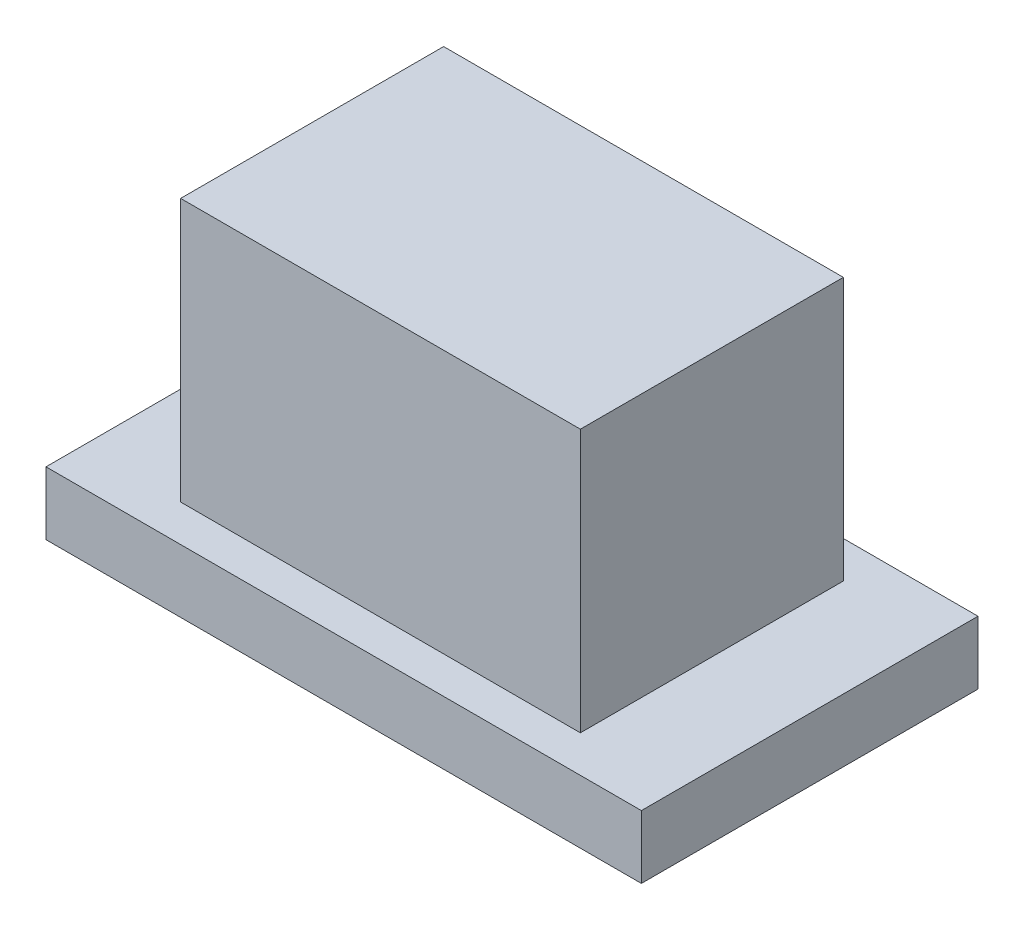
ISO-10303-21;
HEADER;
FILE_DESCRIPTION(('STEP AP214'),'2;1');
FILE_NAME('part.step','',(''),(''),'','','');
FILE_SCHEMA(('AUTOMOTIVE_DESIGN { 1 0 10303 214 1 1 1 1 }'));
ENDSEC;
DATA;
#1=APPLICATION_CONTEXT('core data for automotive mechanical design processes');
#2=APPLICATION_PROTOCOL_DEFINITION('international standard','automotive_design',2000,#1);
#3=PRODUCT_CONTEXT('',#1,'mechanical');
#4=PRODUCT('Part','Part','',(#3));
#5=PRODUCT_RELATED_PRODUCT_CATEGORY('part','',(#4));
#6=PRODUCT_DEFINITION_FORMATION('','',#4);
#7=PRODUCT_DEFINITION_CONTEXT('part definition',#1,'design');
#8=PRODUCT_DEFINITION('design','',#6,#7);
#9=PRODUCT_DEFINITION_SHAPE('','',#8);
#10=(LENGTH_UNIT() NAMED_UNIT(*) SI_UNIT(.MILLI.,.METRE.));
#11=(NAMED_UNIT(*) PLANE_ANGLE_UNIT() SI_UNIT($,.RADIAN.));
#12=(NAMED_UNIT(*) SI_UNIT($,.STERADIAN.) SOLID_ANGLE_UNIT());
#13=UNCERTAINTY_MEASURE_WITH_UNIT(LENGTH_MEASURE(1.E-05),#10,'distance_accuracy_value','');
#14=(GEOMETRIC_REPRESENTATION_CONTEXT(3) GLOBAL_UNCERTAINTY_ASSIGNED_CONTEXT((#13)) GLOBAL_UNIT_ASSIGNED_CONTEXT((#10,
#11,#12)) REPRESENTATION_CONTEXT('',''));
#15=CARTESIAN_POINT('',(0.,0.,0.));
#16=DIRECTION('',(0.,0.,1.));
#17=DIRECTION('',(1.,0.,0.));
#18=AXIS2_PLACEMENT_3D('',#15,#16,#17);
#19=CARTESIAN_POINT('',(-8.66326530612245,3.,-6.0372448979592));
#20=DIRECTION('',(1.,0.,0.));
#21=DIRECTION('',(0.,0.,-1.));
#22=AXIS2_PLACEMENT_3D('',#19,#20,#21);
#23=PLANE('',#22);
#24=DIRECTION('',(0.,0.,1.));
#25=VECTOR('',#24,1.);
#26=CARTESIAN_POINT('',(-8.66326530612245,0.,-6.0372448979592));
#27=LINE('',#26,#25);
#28=CARTESIAN_POINT('',(-8.66326530612245,0.,-6.0372448979592));
#29=VERTEX_POINT('',#28);
#30=CARTESIAN_POINT('',(-8.66326530612245,0.,9.9627551020408));
#31=VERTEX_POINT('',#30);
#32=EDGE_CURVE('E120',#29,#31,#27,.T.);
#33=ORIENTED_EDGE('',*,*,#32,.T.);
#34=DIRECTION('',(0.,-1.,0.));
#35=VECTOR('',#34,1.);
#36=CARTESIAN_POINT('',(-8.66326530612245,3.,9.9627551020408));
#37=LINE('',#36,#35);
#38=CARTESIAN_POINT('',(-8.66326530612245,3.,9.9627551020408));
#39=VERTEX_POINT('',#38);
#40=EDGE_CURVE('E11',#39,#31,#37,.T.);
#41=ORIENTED_EDGE('',*,*,#40,.F.);
#42=DIRECTION('',(0.,0.,1.));
#43=VECTOR('',#42,1.);
#44=CARTESIAN_POINT('',(-8.66326530612245,3.,-6.0372448979592));
#45=LINE('',#44,#43);
#46=CARTESIAN_POINT('',(-8.66326530612245,3.,-6.0372448979592));
#47=VERTEX_POINT('',#46);
#48=EDGE_CURVE('E129',#47,#39,#45,.T.);
#49=ORIENTED_EDGE('',*,*,#48,.F.);
#50=DIRECTION('',(0.,-1.,0.));
#51=VECTOR('',#50,1.);
#52=CARTESIAN_POINT('',(-8.66326530612245,3.,-6.0372448979592));
#53=LINE('',#52,#51);
#54=EDGE_CURVE('E138',#47,#29,#53,.T.);
#55=ORIENTED_EDGE('',*,*,#54,.T.);
#56=EDGE_LOOP('',(#33,#41,#49,#55));
#57=FACE_BOUND('',#56,.T.);
#58=ADVANCED_FACE('F36',(#57),#23,.F.);
#59=CARTESIAN_POINT('',(-8.66326530612245,3.,9.9627551020408));
#60=DIRECTION('',(0.,0.,-1.));
#61=DIRECTION('',(-1.,0.,0.));
#62=AXIS2_PLACEMENT_3D('',#59,#60,#61);
#63=PLANE('',#62);
#64=DIRECTION('',(1.,0.,0.));
#65=VECTOR('',#64,1.);
#66=CARTESIAN_POINT('',(-8.66326530612245,0.,9.9627551020408));
#67=LINE('',#66,#65);
#68=CARTESIAN_POINT('',(19.6367346938775,0.,9.9627551020408));
#69=VERTEX_POINT('',#68);
#70=EDGE_CURVE('E123',#31,#69,#67,.T.);
#71=ORIENTED_EDGE('',*,*,#70,.T.);
#72=DIRECTION('',(0.,-1.,0.));
#73=VECTOR('',#72,1.);
#74=CARTESIAN_POINT('',(19.6367346938775,3.,9.9627551020408));
#75=LINE('',#74,#73);
#76=CARTESIAN_POINT('',(19.6367346938775,3.,9.9627551020408));
#77=VERTEX_POINT('',#76);
#78=EDGE_CURVE('E43',#77,#69,#75,.T.);
#79=ORIENTED_EDGE('',*,*,#78,.F.);
#80=DIRECTION('',(1.,0.,0.));
#81=VECTOR('',#80,1.);
#82=CARTESIAN_POINT('',(-8.66326530612245,3.,9.9627551020408));
#83=LINE('',#82,#81);
#84=EDGE_CURVE('E132',#39,#77,#83,.T.);
#85=ORIENTED_EDGE('',*,*,#84,.F.);
#86=ORIENTED_EDGE('',*,*,#40,.T.);
#87=EDGE_LOOP('',(#71,#79,#85,#86));
#88=FACE_BOUND('',#87,.T.);
#89=ADVANCED_FACE('F169',(#88),#63,.F.);
#90=CARTESIAN_POINT('',(19.6367346938775,3.,-6.0372448979592));
#91=DIRECTION('',(-1.,0.,0.));
#92=DIRECTION('',(0.,0.,1.));
#93=AXIS2_PLACEMENT_3D('',#90,#91,#92);
#94=PLANE('',#93);
#95=DIRECTION('',(0.,0.,-1.));
#96=VECTOR('',#95,1.);
#97=CARTESIAN_POINT('',(19.6367346938775,0.,-6.0372448979592));
#98=LINE('',#97,#96);
#99=CARTESIAN_POINT('',(19.6367346938775,0.,-6.0372448979592));
#100=VERTEX_POINT('',#99);
#101=EDGE_CURVE('E141',#69,#100,#98,.T.);
#102=ORIENTED_EDGE('',*,*,#101,.T.);
#103=DIRECTION('',(0.,-1.,0.));
#104=VECTOR('',#103,1.);
#105=CARTESIAN_POINT('',(19.6367346938775,3.,-6.0372448979592));
#106=LINE('',#105,#104);
#107=CARTESIAN_POINT('',(19.6367346938775,3.,-6.0372448979592));
#108=VERTEX_POINT('',#107);
#109=EDGE_CURVE('E146',#108,#100,#106,.T.);
#110=ORIENTED_EDGE('',*,*,#109,.F.);
#111=DIRECTION('',(0.,0.,-1.));
#112=VECTOR('',#111,1.);
#113=CARTESIAN_POINT('',(19.6367346938775,3.,-6.0372448979592));
#114=LINE('',#113,#112);
#115=EDGE_CURVE('E135',#77,#108,#114,.T.);
#116=ORIENTED_EDGE('',*,*,#115,.F.);
#117=ORIENTED_EDGE('',*,*,#78,.T.);
#118=EDGE_LOOP('',(#102,#110,#116,#117));
#119=FACE_BOUND('',#118,.T.);
#120=ADVANCED_FACE('F153',(#119),#94,.F.);
#121=CARTESIAN_POINT('',(-8.66326530612245,3.,-6.0372448979592));
#122=DIRECTION('',(0.,0.,1.));
#123=DIRECTION('',(1.,0.,0.));
#124=AXIS2_PLACEMENT_3D('',#121,#122,#123);
#125=PLANE('',#124);
#126=DIRECTION('',(-1.,0.,0.));
#127=VECTOR('',#126,1.);
#128=CARTESIAN_POINT('',(-8.66326530612245,0.,-6.0372448979592));
#129=LINE('',#128,#127);
#130=EDGE_CURVE('E133',#100,#29,#129,.T.);
#131=ORIENTED_EDGE('',*,*,#130,.T.);
#132=ORIENTED_EDGE('',*,*,#54,.F.);
#133=DIRECTION('',(-1.,0.,0.));
#134=VECTOR('',#133,1.);
#135=CARTESIAN_POINT('',(-8.66326530612245,3.,-6.0372448979592));
#136=LINE('',#135,#134);
#137=EDGE_CURVE('E137',#108,#47,#136,.T.);
#138=ORIENTED_EDGE('',*,*,#137,.F.);
#139=ORIENTED_EDGE('',*,*,#109,.T.);
#140=EDGE_LOOP('',(#131,#132,#138,#139));
#141=FACE_BOUND('',#140,.T.);
#142=ADVANCED_FACE('F162',(#141),#125,.F.);
#143=CARTESIAN_POINT('',(0.,3.,0.));
#144=DIRECTION('',(0.,1.,0.));
#145=DIRECTION('',(0.,0.,1.));
#146=AXIS2_PLACEMENT_3D('',#143,#144,#145);
#147=PLANE('',#146);
#148=DIRECTION('',(0.,0.,1.));
#149=VECTOR('',#148,1.);
#150=CARTESIAN_POINT('',(-4.01326530612245,3.,-4.2872448979592));
#151=LINE('',#150,#149);
#152=CARTESIAN_POINT('',(-4.01326530612245,3.,-4.2872448979592));
#153=VERTEX_POINT('',#152);
#154=CARTESIAN_POINT('',(-4.01326530612245,3.,8.2127551020408));
#155=VERTEX_POINT('',#154);
#156=EDGE_CURVE('E50',#153,#155,#151,.T.);
#157=ORIENTED_EDGE('',*,*,#156,.F.);
#158=DIRECTION('',(-1.,0.,0.));
#159=VECTOR('',#158,1.);
#160=CARTESIAN_POINT('',(-4.01326530612245,3.,-4.2872448979592));
#161=LINE('',#160,#159);
#162=CARTESIAN_POINT('',(14.9867346938775,3.,-4.2872448979592));
#163=VERTEX_POINT('',#162);
#164=EDGE_CURVE('E54',#163,#153,#161,.T.);
#165=ORIENTED_EDGE('',*,*,#164,.F.);
#166=DIRECTION('',(0.,0.,-1.));
#167=VECTOR('',#166,1.);
#168=CARTESIAN_POINT('',(14.9867346938775,3.,-4.2872448979592));
#169=LINE('',#168,#167);
#170=CARTESIAN_POINT('',(14.9867346938775,3.,8.21275510204081));
#171=VERTEX_POINT('',#170);
#172=EDGE_CURVE('E265',#171,#163,#169,.T.);
#173=ORIENTED_EDGE('',*,*,#172,.F.);
#174=DIRECTION('',(1.,0.,0.));
#175=VECTOR('',#174,1.);
#176=CARTESIAN_POINT('',(-4.01326530612245,3.,8.2127551020408));
#177=LINE('',#176,#175);
#178=EDGE_CURVE('E271',#155,#171,#177,.T.);
#179=ORIENTED_EDGE('',*,*,#178,.F.);
#180=EDGE_LOOP('',(#157,#165,#173,#179));
#181=FACE_BOUND('',#180,.T.);
#182=ORIENTED_EDGE('',*,*,#48,.T.);
#183=ORIENTED_EDGE('',*,*,#84,.T.);
#184=ORIENTED_EDGE('',*,*,#115,.T.);
#185=ORIENTED_EDGE('',*,*,#137,.T.);
#186=EDGE_LOOP('',(#182,#183,#184,#185));
#187=FACE_BOUND('',#186,.T.);
#188=ADVANCED_FACE('F168',(#181,#187),#147,.T.);
#189=CARTESIAN_POINT('',(0.,0.,0.));
#190=DIRECTION('',(0.,1.,0.));
#191=DIRECTION('',(0.,0.,1.));
#192=AXIS2_PLACEMENT_3D('',#189,#190,#191);
#193=PLANE('',#192);
#194=ORIENTED_EDGE('',*,*,#32,.F.);
#195=ORIENTED_EDGE('',*,*,#130,.F.);
#196=ORIENTED_EDGE('',*,*,#101,.F.);
#197=ORIENTED_EDGE('',*,*,#70,.F.);
#198=EDGE_LOOP('',(#194,#195,#196,#197));
#199=FACE_BOUND('',#198,.T.);
#200=ADVANCED_FACE('F159',(#199),#193,.F.);
#201=CARTESIAN_POINT('',(-4.01326530612245,15.5,-4.2872448979592));
#202=DIRECTION('',(1.,0.,0.));
#203=DIRECTION('',(0.,0.,-1.));
#204=AXIS2_PLACEMENT_3D('',#201,#202,#203);
#205=PLANE('',#204);
#206=ORIENTED_EDGE('',*,*,#156,.T.);
#207=DIRECTION('',(0.,-1.,0.));
#208=VECTOR('',#207,1.);
#209=CARTESIAN_POINT('',(-4.01326530612245,15.5,8.2127551020408));
#210=LINE('',#209,#208);
#211=CARTESIAN_POINT('',(-4.01326530612245,15.5,8.2127551020408));
#212=VERTEX_POINT('',#211);
#213=EDGE_CURVE('E103',#212,#155,#210,.T.);
#214=ORIENTED_EDGE('',*,*,#213,.F.);
#215=DIRECTION('',(0.,0.,1.));
#216=VECTOR('',#215,1.);
#217=CARTESIAN_POINT('',(-4.01326530612245,15.5,-4.2872448979592));
#218=LINE('',#217,#216);
#219=CARTESIAN_POINT('',(-4.01326530612245,15.5,-4.2872448979592));
#220=VERTEX_POINT('',#219);
#221=EDGE_CURVE('E109',#220,#212,#218,.T.);
#222=ORIENTED_EDGE('',*,*,#221,.F.);
#223=DIRECTION('',(0.,-1.,0.));
#224=VECTOR('',#223,1.);
#225=CARTESIAN_POINT('',(-4.01326530612245,15.5,-4.2872448979592));
#226=LINE('',#225,#224);
#227=EDGE_CURVE('E263',#220,#153,#226,.T.);
#228=ORIENTED_EDGE('',*,*,#227,.T.);
#229=EDGE_LOOP('',(#206,#214,#222,#228));
#230=FACE_BOUND('',#229,.T.);
#231=ADVANCED_FACE('F119',(#230),#205,.F.);
#232=CARTESIAN_POINT('',(-4.01326530612245,15.5,8.2127551020408));
#233=DIRECTION('',(0.,0.,-1.));
#234=DIRECTION('',(-1.,0.,0.));
#235=AXIS2_PLACEMENT_3D('',#232,#233,#234);
#236=PLANE('',#235);
#237=ORIENTED_EDGE('',*,*,#178,.T.);
#238=DIRECTION('',(0.,-1.,0.));
#239=VECTOR('',#238,1.);
#240=CARTESIAN_POINT('',(14.9867346938775,15.5,8.21275510204081));
#241=LINE('',#240,#239);
#242=CARTESIAN_POINT('',(14.9867346938775,15.5,8.21275510204081));
#243=VERTEX_POINT('',#242);
#244=EDGE_CURVE('E105',#243,#171,#241,.T.);
#245=ORIENTED_EDGE('',*,*,#244,.F.);
#246=DIRECTION('',(1.,0.,0.));
#247=VECTOR('',#246,1.);
#248=CARTESIAN_POINT('',(-4.01326530612245,15.5,8.2127551020408));
#249=LINE('',#248,#247);
#250=EDGE_CURVE('E98',#212,#243,#249,.T.);
#251=ORIENTED_EDGE('',*,*,#250,.F.);
#252=ORIENTED_EDGE('',*,*,#213,.T.);
#253=EDGE_LOOP('',(#237,#245,#251,#252));
#254=FACE_BOUND('',#253,.T.);
#255=ADVANCED_FACE('F101',(#254),#236,.F.);
#256=CARTESIAN_POINT('',(14.9867346938775,15.5,-4.2872448979592));
#257=DIRECTION('',(-1.,0.,0.));
#258=DIRECTION('',(0.,0.,1.));
#259=AXIS2_PLACEMENT_3D('',#256,#257,#258);
#260=PLANE('',#259);
#261=ORIENTED_EDGE('',*,*,#172,.T.);
#262=DIRECTION('',(0.,-1.,0.));
#263=VECTOR('',#262,1.);
#264=CARTESIAN_POINT('',(14.9867346938775,15.5,-4.2872448979592));
#265=LINE('',#264,#263);
#266=CARTESIAN_POINT('',(14.9867346938775,15.5,-4.2872448979592));
#267=VERTEX_POINT('',#266);
#268=EDGE_CURVE('E125',#267,#163,#265,.T.);
#269=ORIENTED_EDGE('',*,*,#268,.F.);
#270=DIRECTION('',(0.,0.,-1.));
#271=VECTOR('',#270,1.);
#272=CARTESIAN_POINT('',(14.9867346938775,15.5,-4.2872448979592));
#273=LINE('',#272,#271);
#274=EDGE_CURVE('E108',#243,#267,#273,.T.);
#275=ORIENTED_EDGE('',*,*,#274,.F.);
#276=ORIENTED_EDGE('',*,*,#244,.T.);
#277=EDGE_LOOP('',(#261,#269,#275,#276));
#278=FACE_BOUND('',#277,.T.);
#279=ADVANCED_FACE('F187',(#278),#260,.F.);
#280=CARTESIAN_POINT('',(-4.01326530612245,15.5,-4.2872448979592));
#281=DIRECTION('',(0.,0.,1.));
#282=DIRECTION('',(1.,0.,0.));
#283=AXIS2_PLACEMENT_3D('',#280,#281,#282);
#284=PLANE('',#283);
#285=ORIENTED_EDGE('',*,*,#164,.T.);
#286=ORIENTED_EDGE('',*,*,#227,.F.);
#287=DIRECTION('',(-1.,0.,0.));
#288=VECTOR('',#287,1.);
#289=CARTESIAN_POINT('',(-4.01326530612245,15.5,-4.2872448979592));
#290=LINE('',#289,#288);
#291=EDGE_CURVE('E114',#267,#220,#290,.T.);
#292=ORIENTED_EDGE('',*,*,#291,.F.);
#293=ORIENTED_EDGE('',*,*,#268,.T.);
#294=EDGE_LOOP('',(#285,#286,#292,#293));
#295=FACE_BOUND('',#294,.T.);
#296=ADVANCED_FACE('F190',(#295),#284,.F.);
#297=CARTESIAN_POINT('',(0.,15.5,0.));
#298=DIRECTION('',(0.,1.,0.));
#299=DIRECTION('',(0.,0.,1.));
#300=AXIS2_PLACEMENT_3D('',#297,#298,#299);
#301=PLANE('',#300);
#302=ORIENTED_EDGE('',*,*,#221,.T.);
#303=ORIENTED_EDGE('',*,*,#250,.T.);
#304=ORIENTED_EDGE('',*,*,#274,.T.);
#305=ORIENTED_EDGE('',*,*,#291,.T.);
#306=EDGE_LOOP('',(#302,#303,#304,#305));
#307=FACE_BOUND('',#306,.T.);
#308=ADVANCED_FACE('F112',(#307),#301,.T.);
#309=CLOSED_SHELL('',(#58,#89,#120,#142,#188,#200,#231,#255,#279,#296,#308));
#310=MANIFOLD_SOLID_BREP('B2',#309);
#311=ADVANCED_BREP_SHAPE_REPRESENTATION('',(#18,#310),#14);
#312=SHAPE_DEFINITION_REPRESENTATION(#9,#311);
ENDSEC;
END-ISO-10303-21;
